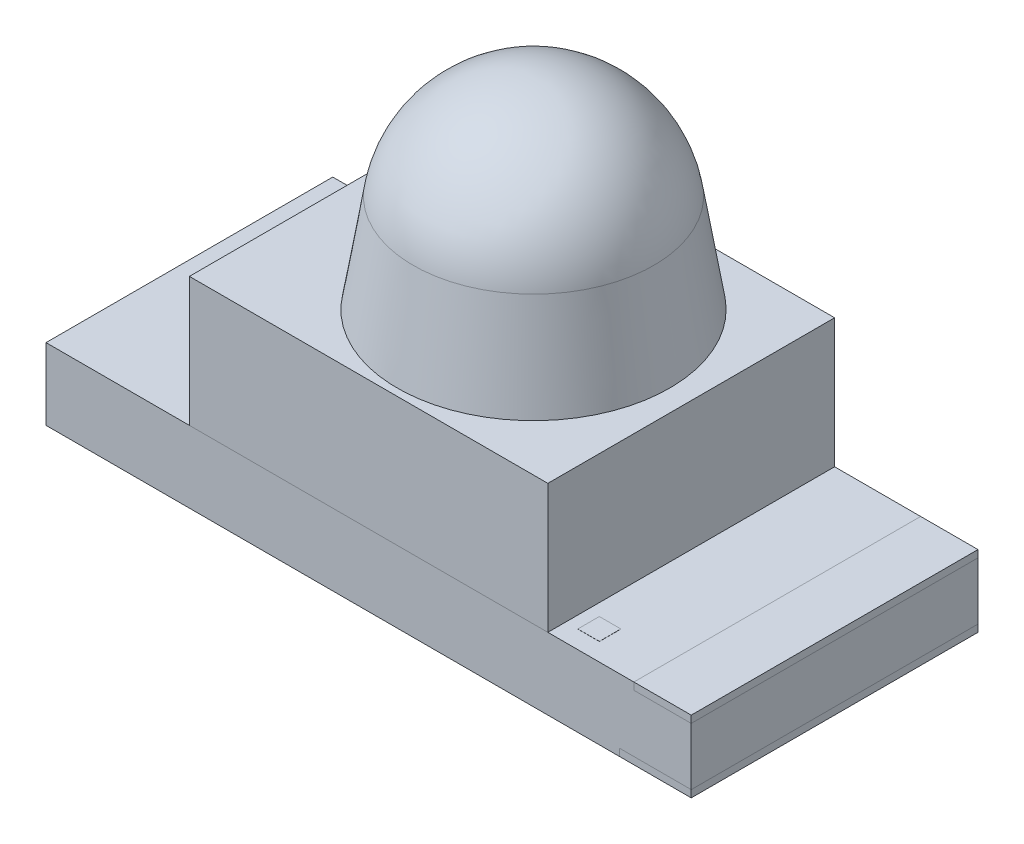
ISO-10303-21;
HEADER;
FILE_DESCRIPTION(('STEP AP214'),'2;1');
FILE_NAME('part.step','',(''),(''),'','','');
FILE_SCHEMA(('AUTOMOTIVE_DESIGN { 1 0 10303 214 1 1 1 1 }'));
ENDSEC;
DATA;
#1=APPLICATION_CONTEXT('core data for automotive mechanical design processes');
#2=APPLICATION_PROTOCOL_DEFINITION('international standard','automotive_design',2000,#1);
#3=PRODUCT_CONTEXT('',#1,'mechanical');
#4=PRODUCT('Part','Part','',(#3));
#5=PRODUCT_RELATED_PRODUCT_CATEGORY('part','',(#4));
#6=PRODUCT_DEFINITION_FORMATION('','',#4);
#7=PRODUCT_DEFINITION_CONTEXT('part definition',#1,'design');
#8=PRODUCT_DEFINITION('design','',#6,#7);
#9=PRODUCT_DEFINITION_SHAPE('','',#8);
#10=(LENGTH_UNIT() NAMED_UNIT(*) SI_UNIT(.MILLI.,.METRE.));
#11=(NAMED_UNIT(*) PLANE_ANGLE_UNIT() SI_UNIT($,.RADIAN.));
#12=(NAMED_UNIT(*) SI_UNIT($,.STERADIAN.) SOLID_ANGLE_UNIT());
#13=UNCERTAINTY_MEASURE_WITH_UNIT(LENGTH_MEASURE(1.E-05),#10,'distance_accuracy_value','');
#14=(GEOMETRIC_REPRESENTATION_CONTEXT(3) GLOBAL_UNCERTAINTY_ASSIGNED_CONTEXT((#13)) GLOBAL_UNIT_ASSIGNED_CONTEXT((#10,
#11,#12)) REPRESENTATION_CONTEXT('',''));
#15=CARTESIAN_POINT('',(0.,0.,0.));
#16=DIRECTION('',(0.,0.,1.));
#17=DIRECTION('',(1.,0.,0.));
#18=AXIS2_PLACEMENT_3D('',#15,#16,#17);
#19=CARTESIAN_POINT('',(-0.2,0.24,0.875846333056723));
#20=DIRECTION('',(0.,0.,-1.));
#21=DIRECTION('',(-1.,0.,0.));
#22=AXIS2_PLACEMENT_3D('',#19,#20,#21);
#23=PLANE('',#22);
#24=DIRECTION('',(0.,1.,0.));
#25=VECTOR('',#24,1.);
#26=CARTESIAN_POINT('',(1.48500300031996,0.24,0.875846333056723));
#27=LINE('',#26,#25);
#28=CARTESIAN_POINT('',(1.48500300031996,0.24,0.875846333056723));
#29=VERTEX_POINT('',#28);
#30=CARTESIAN_POINT('',(1.48500300031996,0.251,0.875846333056723));
#31=VERTEX_POINT('',#30);
#32=EDGE_CURVE('E47',#29,#31,#27,.T.);
#33=ORIENTED_EDGE('',*,*,#32,.T.);
#34=DIRECTION('',(-1.,0.,0.));
#35=VECTOR('',#34,1.);
#36=CARTESIAN_POINT('',(-0.2,0.251,0.875846333056723));
#37=LINE('',#36,#35);
#38=CARTESIAN_POINT('',(1.33500300031996,0.251,0.875846333056723));
#39=VERTEX_POINT('',#38);
#40=EDGE_CURVE('E86',#31,#39,#37,.T.);
#41=ORIENTED_EDGE('',*,*,#40,.T.);
#42=DIRECTION('',(0.,1.,0.));
#43=VECTOR('',#42,1.);
#44=CARTESIAN_POINT('',(1.33500300031996,0.24,0.875846333056723));
#45=LINE('',#44,#43);
#46=CARTESIAN_POINT('',(1.33500300031996,0.24,0.875846333056723));
#47=VERTEX_POINT('',#46);
#48=EDGE_CURVE('E12',#47,#39,#45,.T.);
#49=ORIENTED_EDGE('',*,*,#48,.F.);
#50=DIRECTION('',(-1.,0.,0.));
#51=VECTOR('',#50,1.);
#52=CARTESIAN_POINT('',(-0.2,0.24,0.875846333056723));
#53=LINE('',#52,#51);
#54=EDGE_CURVE('E88',#29,#47,#53,.T.);
#55=ORIENTED_EDGE('',*,*,#54,.F.);
#56=EDGE_LOOP('',(#33,#41,#49,#55));
#57=FACE_BOUND('',#56,.T.);
#58=ADVANCED_FACE('F44',(#57),#23,.F.);
#59=CARTESIAN_POINT('',(1.33500300031996,0.24,-3.68966740182096));
#60=DIRECTION('',(1.,0.,0.));
#61=DIRECTION('',(0.,0.,-1.));
#62=AXIS2_PLACEMENT_3D('',#59,#60,#61);
#63=PLANE('',#62);
#64=ORIENTED_EDGE('',*,*,#48,.T.);
#65=DIRECTION('',(0.,0.,-1.));
#66=VECTOR('',#65,1.);
#67=CARTESIAN_POINT('',(1.33500300031996,0.251,-3.68966740182096));
#68=LINE('',#67,#66);
#69=CARTESIAN_POINT('',(1.33500300031996,0.251,0.725846333056723));
#70=VERTEX_POINT('',#69);
#71=EDGE_CURVE('E103',#39,#70,#68,.T.);
#72=ORIENTED_EDGE('',*,*,#71,.T.);
#73=DIRECTION('',(0.,1.,0.));
#74=VECTOR('',#73,1.);
#75=CARTESIAN_POINT('',(1.33500300031996,0.24,0.725846333056723));
#76=LINE('',#75,#74);
#77=CARTESIAN_POINT('',(1.33500300031996,0.24,0.725846333056723));
#78=VERTEX_POINT('',#77);
#79=EDGE_CURVE('E52',#78,#70,#76,.T.);
#80=ORIENTED_EDGE('',*,*,#79,.F.);
#81=DIRECTION('',(0.,0.,-1.));
#82=VECTOR('',#81,1.);
#83=CARTESIAN_POINT('',(1.33500300031996,0.24,-3.68966740182096));
#84=LINE('',#83,#82);
#85=EDGE_CURVE('E59',#47,#78,#84,.T.);
#86=ORIENTED_EDGE('',*,*,#85,.F.);
#87=EDGE_LOOP('',(#64,#72,#80,#86));
#88=FACE_BOUND('',#87,.T.);
#89=ADVANCED_FACE('F117',(#88),#63,.F.);
#90=CARTESIAN_POINT('',(-0.199999999999997,0.24,0.725846333056724));
#91=DIRECTION('',(0.,0.,-1.));
#92=DIRECTION('',(-1.,0.,0.));
#93=AXIS2_PLACEMENT_3D('',#90,#91,#92);
#94=PLANE('',#93);
#95=ORIENTED_EDGE('',*,*,#79,.T.);
#96=DIRECTION('',(-1.,0.,0.));
#97=VECTOR('',#96,1.);
#98=CARTESIAN_POINT('',(-0.199999999999997,0.251,0.725846333056724));
#99=LINE('',#98,#97);
#100=CARTESIAN_POINT('',(1.48500300031996,0.251,0.725846333056723));
#101=VERTEX_POINT('',#100);
#102=EDGE_CURVE('E99',#101,#70,#99,.T.);
#103=ORIENTED_EDGE('',*,*,#102,.F.);
#104=DIRECTION('',(0.,1.,0.));
#105=VECTOR('',#104,1.);
#106=CARTESIAN_POINT('',(1.48500300031996,0.24,0.725846333056723));
#107=LINE('',#106,#105);
#108=CARTESIAN_POINT('',(1.48500300031996,0.24,0.725846333056723));
#109=VERTEX_POINT('',#108);
#110=EDGE_CURVE('E92',#109,#101,#107,.T.);
#111=ORIENTED_EDGE('',*,*,#110,.F.);
#112=DIRECTION('',(-1.,0.,0.));
#113=VECTOR('',#112,1.);
#114=CARTESIAN_POINT('',(-0.199999999999997,0.24,0.725846333056724));
#115=LINE('',#114,#113);
#116=EDGE_CURVE('E111',#109,#78,#115,.T.);
#117=ORIENTED_EDGE('',*,*,#116,.T.);
#118=EDGE_LOOP('',(#95,#103,#111,#117));
#119=FACE_BOUND('',#118,.T.);
#120=ADVANCED_FACE('F116',(#119),#94,.T.);
#121=CARTESIAN_POINT('',(1.48500300031996,0.24,-3.68966740182096));
#122=DIRECTION('',(1.,0.,0.));
#123=DIRECTION('',(0.,0.,-1.));
#124=AXIS2_PLACEMENT_3D('',#121,#122,#123);
#125=PLANE('',#124);
#126=ORIENTED_EDGE('',*,*,#110,.T.);
#127=DIRECTION('',(0.,0.,-1.));
#128=VECTOR('',#127,1.);
#129=CARTESIAN_POINT('',(1.48500300031996,0.251,-3.68966740182096));
#130=LINE('',#129,#128);
#131=EDGE_CURVE('E94',#31,#101,#130,.T.);
#132=ORIENTED_EDGE('',*,*,#131,.F.);
#133=ORIENTED_EDGE('',*,*,#32,.F.);
#134=DIRECTION('',(0.,0.,-1.));
#135=VECTOR('',#134,1.);
#136=CARTESIAN_POINT('',(1.48500300031996,0.24,-3.68966740182096));
#137=LINE('',#136,#135);
#138=EDGE_CURVE('E109',#29,#109,#137,.T.);
#139=ORIENTED_EDGE('',*,*,#138,.T.);
#140=EDGE_LOOP('',(#126,#132,#133,#139));
#141=FACE_BOUND('',#140,.T.);
#142=ADVANCED_FACE('F95',(#141),#125,.T.);
#143=CARTESIAN_POINT('',(-0.2,0.24,-3.68966740182096));
#144=DIRECTION('',(0.,-1.,0.));
#145=DIRECTION('',(0.,0.,-1.));
#146=AXIS2_PLACEMENT_3D('',#143,#144,#145);
#147=PLANE('',#146);
#148=ORIENTED_EDGE('',*,*,#54,.T.);
#149=ORIENTED_EDGE('',*,*,#85,.T.);
#150=ORIENTED_EDGE('',*,*,#116,.F.);
#151=ORIENTED_EDGE('',*,*,#138,.F.);
#152=EDGE_LOOP('',(#148,#149,#150,#151));
#153=FACE_BOUND('',#152,.T.);
#154=ADVANCED_FACE('F126',(#153),#147,.T.);
#155=CARTESIAN_POINT('',(-0.2,0.251,-3.68966740182096));
#156=DIRECTION('',(0.,-1.,0.));
#157=DIRECTION('',(0.,0.,-1.));
#158=AXIS2_PLACEMENT_3D('',#155,#156,#157);
#159=PLANE('',#158);
#160=ORIENTED_EDGE('',*,*,#40,.F.);
#161=ORIENTED_EDGE('',*,*,#131,.T.);
#162=ORIENTED_EDGE('',*,*,#102,.T.);
#163=ORIENTED_EDGE('',*,*,#71,.F.);
#164=EDGE_LOOP('',(#160,#161,#162,#163));
#165=FACE_BOUND('',#164,.T.);
#166=ADVANCED_FACE('F101',(#165),#159,.F.);
#167=CLOSED_SHELL('',(#58,#89,#120,#142,#154,#166));
#168=MANIFOLD_SOLID_BREP('B2',#167);
#169=CARTESIAN_POINT('',(0.0565024962447392,-0.200000000000001,1.));
#170=DIRECTION('',(0.,-1.,0.));
#171=DIRECTION('',(1.,0.,0.));
#172=AXIS2_PLACEMENT_3D('',#169,#170,#171);
#173=PLANE('',#172);
#174=DIRECTION('',(-1.,0.,0.));
#175=VECTOR('',#174,1.);
#176=CARTESIAN_POINT('',(0.0565024962447392,-0.200000000000001,-1.));
#177=LINE('',#176,#175);
#178=CARTESIAN_POINT('',(2.25,-0.2,-1.));
#179=VERTEX_POINT('',#178);
#180=CARTESIAN_POINT('',(1.75,-0.2,-1.));
#181=VERTEX_POINT('',#180);
#182=EDGE_CURVE('E224',#179,#181,#177,.T.);
#183=ORIENTED_EDGE('',*,*,#182,.T.);
#184=DIRECTION('',(0.,0.,-1.));
#185=VECTOR('',#184,1.);
#186=CARTESIAN_POINT('',(1.75,-0.2,1.));
#187=LINE('',#186,#185);
#188=CARTESIAN_POINT('',(1.75,-0.2,1.));
#189=VERTEX_POINT('',#188);
#190=EDGE_CURVE('E42',#189,#181,#187,.T.);
#191=ORIENTED_EDGE('',*,*,#190,.F.);
#192=DIRECTION('',(-1.,0.,0.));
#193=VECTOR('',#192,1.);
#194=CARTESIAN_POINT('',(0.0565024962447392,-0.200000000000001,1.));
#195=LINE('',#194,#193);
#196=CARTESIAN_POINT('',(2.25,-0.2,1.));
#197=VERTEX_POINT('',#196);
#198=EDGE_CURVE('E241',#197,#189,#195,.T.);
#199=ORIENTED_EDGE('',*,*,#198,.F.);
#200=DIRECTION('',(0.,0.,-1.));
#201=VECTOR('',#200,1.);
#202=CARTESIAN_POINT('',(2.25,-0.2,1.));
#203=LINE('',#202,#201);
#204=EDGE_CURVE('E192',#197,#179,#203,.T.);
#205=ORIENTED_EDGE('',*,*,#204,.T.);
#206=EDGE_LOOP('',(#183,#191,#199,#205));
#207=FACE_BOUND('',#206,.T.);
#208=ADVANCED_FACE('F178',(#207),#173,.F.);
#209=CARTESIAN_POINT('',(1.75000000000003,-3.84653576035237,1.));
#210=DIRECTION('',(1.,0.,0.));
#211=DIRECTION('',(0.,1.,0.));
#212=AXIS2_PLACEMENT_3D('',#209,#210,#211);
#213=PLANE('',#212);
#214=DIRECTION('',(0.,-1.,0.));
#215=VECTOR('',#214,1.);
#216=CARTESIAN_POINT('',(1.75000000000003,-3.84653576035237,-1.));
#217=LINE('',#216,#215);
#218=CARTESIAN_POINT('',(1.75,-0.25,-1.));
#219=VERTEX_POINT('',#218);
#220=EDGE_CURVE('E220',#181,#219,#217,.T.);
#221=ORIENTED_EDGE('',*,*,#220,.T.);
#222=DIRECTION('',(0.,0.,-1.));
#223=VECTOR('',#222,1.);
#224=CARTESIAN_POINT('',(1.75,-0.25,1.));
#225=LINE('',#224,#223);
#226=CARTESIAN_POINT('',(1.75,-0.25,1.));
#227=VERTEX_POINT('',#226);
#228=EDGE_CURVE('E185',#227,#219,#225,.T.);
#229=ORIENTED_EDGE('',*,*,#228,.F.);
#230=DIRECTION('',(0.,-1.,0.));
#231=VECTOR('',#230,1.);
#232=CARTESIAN_POINT('',(1.75000000000003,-3.84653576035237,1.));
#233=LINE('',#232,#231);
#234=EDGE_CURVE('E233',#189,#227,#233,.T.);
#235=ORIENTED_EDGE('',*,*,#234,.F.);
#236=ORIENTED_EDGE('',*,*,#190,.T.);
#237=EDGE_LOOP('',(#221,#229,#235,#236));
#238=FACE_BOUND('',#237,.T.);
#239=ADVANCED_FACE('F232',(#238),#213,.F.);
#240=CARTESIAN_POINT('',(0.0565024962447396,-0.25,1.));
#241=DIRECTION('',(0.,1.,0.));
#242=DIRECTION('',(0.,0.,1.));
#243=AXIS2_PLACEMENT_3D('',#240,#241,#242);
#244=PLANE('',#243);
#245=DIRECTION('',(1.,0.,0.));
#246=VECTOR('',#245,1.);
#247=CARTESIAN_POINT('',(0.0565024962447396,-0.25,-1.));
#248=LINE('',#247,#246);
#249=CARTESIAN_POINT('',(2.25,-0.25,-1.));
#250=VERTEX_POINT('',#249);
#251=EDGE_CURVE('E226',#219,#250,#248,.T.);
#252=ORIENTED_EDGE('',*,*,#251,.T.);
#253=DIRECTION('',(0.,0.,-1.));
#254=VECTOR('',#253,1.);
#255=CARTESIAN_POINT('',(2.25,-0.25,1.));
#256=LINE('',#255,#254);
#257=CARTESIAN_POINT('',(2.25,-0.25,1.));
#258=VERTEX_POINT('',#257);
#259=EDGE_CURVE('E248',#258,#250,#256,.T.);
#260=ORIENTED_EDGE('',*,*,#259,.F.);
#261=DIRECTION('',(1.,0.,0.));
#262=VECTOR('',#261,1.);
#263=CARTESIAN_POINT('',(0.0565024962447396,-0.25,1.));
#264=LINE('',#263,#262);
#265=EDGE_CURVE('E200',#227,#258,#264,.T.);
#266=ORIENTED_EDGE('',*,*,#265,.F.);
#267=ORIENTED_EDGE('',*,*,#228,.T.);
#268=EDGE_LOOP('',(#252,#260,#266,#267));
#269=FACE_BOUND('',#268,.T.);
#270=ADVANCED_FACE('F250',(#269),#244,.F.);
#271=CARTESIAN_POINT('',(2.25,-3.84653576035239,1.));
#272=DIRECTION('',(1.,0.,0.));
#273=DIRECTION('',(0.,1.,0.));
#274=AXIS2_PLACEMENT_3D('',#271,#272,#273);
#275=PLANE('',#274);
#276=DIRECTION('',(0.,-1.,0.));
#277=VECTOR('',#276,1.);
#278=CARTESIAN_POINT('',(2.25,-3.84653576035239,-1.));
#279=LINE('',#278,#277);
#280=EDGE_CURVE('E239',#179,#250,#279,.T.);
#281=ORIENTED_EDGE('',*,*,#280,.F.);
#282=ORIENTED_EDGE('',*,*,#204,.F.);
#283=DIRECTION('',(0.,-1.,0.));
#284=VECTOR('',#283,1.);
#285=CARTESIAN_POINT('',(2.25,-3.84653576035239,1.));
#286=LINE('',#285,#284);
#287=EDGE_CURVE('E245',#197,#258,#286,.T.);
#288=ORIENTED_EDGE('',*,*,#287,.T.);
#289=ORIENTED_EDGE('',*,*,#259,.T.);
#290=EDGE_LOOP('',(#281,#282,#288,#289));
#291=FACE_BOUND('',#290,.T.);
#292=ADVANCED_FACE('F251',(#291),#275,.T.);
#293=CARTESIAN_POINT('',(0.0565024962447396,-3.84653576035239,1.));
#294=DIRECTION('',(0.,0.,1.));
#295=DIRECTION('',(1.,0.,0.));
#296=AXIS2_PLACEMENT_3D('',#293,#294,#295);
#297=PLANE('',#296);
#298=ORIENTED_EDGE('',*,*,#198,.T.);
#299=ORIENTED_EDGE('',*,*,#234,.T.);
#300=ORIENTED_EDGE('',*,*,#265,.T.);
#301=ORIENTED_EDGE('',*,*,#287,.F.);
#302=EDGE_LOOP('',(#298,#299,#300,#301));
#303=FACE_BOUND('',#302,.T.);
#304=ADVANCED_FACE('F252',(#303),#297,.T.);
#305=CARTESIAN_POINT('',(0.0565024962447396,-3.84653576035239,-1.));
#306=DIRECTION('',(0.,0.,1.));
#307=DIRECTION('',(1.,0.,0.));
#308=AXIS2_PLACEMENT_3D('',#305,#306,#307);
#309=PLANE('',#308);
#310=ORIENTED_EDGE('',*,*,#182,.F.);
#311=ORIENTED_EDGE('',*,*,#280,.T.);
#312=ORIENTED_EDGE('',*,*,#251,.F.);
#313=ORIENTED_EDGE('',*,*,#220,.F.);
#314=EDGE_LOOP('',(#310,#311,#312,#313));
#315=FACE_BOUND('',#314,.T.);
#316=ADVANCED_FACE('F221',(#315),#309,.F.);
#317=CLOSED_SHELL('',(#208,#239,#270,#292,#304,#316));
#318=MANIFOLD_SOLID_BREP('B6',#317);
#319=CARTESIAN_POINT('',(1.85000000000002,-3.84653576035238,1.));
#320=DIRECTION('',(1.,0.,0.));
#321=DIRECTION('',(0.,1.,0.));
#322=AXIS2_PLACEMENT_3D('',#319,#320,#321);
#323=PLANE('',#322);
#324=DIRECTION('',(0.,-1.,0.));
#325=VECTOR('',#324,1.);
#326=CARTESIAN_POINT('',(1.85000000000002,-3.84653576035238,-1.));
#327=LINE('',#326,#325);
#328=CARTESIAN_POINT('',(1.85,0.25,-1.));
#329=VERTEX_POINT('',#328);
#330=CARTESIAN_POINT('',(1.85,0.2,-1.));
#331=VERTEX_POINT('',#330);
#332=EDGE_CURVE('E359',#329,#331,#327,.T.);
#333=ORIENTED_EDGE('',*,*,#332,.T.);
#334=DIRECTION('',(0.,0.,-1.));
#335=VECTOR('',#334,1.);
#336=CARTESIAN_POINT('',(1.85,0.2,1.));
#337=LINE('',#336,#335);
#338=CARTESIAN_POINT('',(1.85,0.2,1.));
#339=VERTEX_POINT('',#338);
#340=EDGE_CURVE('E176',#339,#331,#337,.T.);
#341=ORIENTED_EDGE('',*,*,#340,.F.);
#342=DIRECTION('',(0.,-1.,0.));
#343=VECTOR('',#342,1.);
#344=CARTESIAN_POINT('',(1.85000000000002,-3.84653576035238,1.));
#345=LINE('',#344,#343);
#346=CARTESIAN_POINT('',(1.85,0.25,1.));
#347=VERTEX_POINT('',#346);
#348=EDGE_CURVE('E374',#347,#339,#345,.T.);
#349=ORIENTED_EDGE('',*,*,#348,.F.);
#350=DIRECTION('',(0.,0.,-1.));
#351=VECTOR('',#350,1.);
#352=CARTESIAN_POINT('',(1.85,0.25,1.));
#353=LINE('',#352,#351);
#354=EDGE_CURVE('E326',#347,#329,#353,.T.);
#355=ORIENTED_EDGE('',*,*,#354,.T.);
#356=EDGE_LOOP('',(#333,#341,#349,#355));
#357=FACE_BOUND('',#356,.T.);
#358=ADVANCED_FACE('F312',(#357),#323,.F.);
#359=CARTESIAN_POINT('',(0.0565024962447396,0.2,1.));
#360=DIRECTION('',(0.,1.,0.));
#361=DIRECTION('',(0.,0.,1.));
#362=AXIS2_PLACEMENT_3D('',#359,#360,#361);
#363=PLANE('',#362);
#364=DIRECTION('',(1.,0.,0.));
#365=VECTOR('',#364,1.);
#366=CARTESIAN_POINT('',(0.0565024962447396,0.2,-1.));
#367=LINE('',#366,#365);
#368=CARTESIAN_POINT('',(2.25,0.2,-1.));
#369=VERTEX_POINT('',#368);
#370=EDGE_CURVE('E355',#331,#369,#367,.T.);
#371=ORIENTED_EDGE('',*,*,#370,.T.);
#372=DIRECTION('',(0.,0.,-1.));
#373=VECTOR('',#372,1.);
#374=CARTESIAN_POINT('',(2.25,0.2,1.));
#375=LINE('',#374,#373);
#376=CARTESIAN_POINT('',(2.25,0.2,1.));
#377=VERTEX_POINT('',#376);
#378=EDGE_CURVE('E319',#377,#369,#375,.T.);
#379=ORIENTED_EDGE('',*,*,#378,.F.);
#380=DIRECTION('',(1.,0.,0.));
#381=VECTOR('',#380,1.);
#382=CARTESIAN_POINT('',(0.0565024962447396,0.2,1.));
#383=LINE('',#382,#381);
#384=EDGE_CURVE('E366',#339,#377,#383,.T.);
#385=ORIENTED_EDGE('',*,*,#384,.F.);
#386=ORIENTED_EDGE('',*,*,#340,.T.);
#387=EDGE_LOOP('',(#371,#379,#385,#386));
#388=FACE_BOUND('',#387,.T.);
#389=ADVANCED_FACE('F365',(#388),#363,.F.);
#390=CARTESIAN_POINT('',(2.25,-3.84653576035239,1.));
#391=DIRECTION('',(1.,0.,0.));
#392=DIRECTION('',(0.,1.,0.));
#393=AXIS2_PLACEMENT_3D('',#390,#391,#392);
#394=PLANE('',#393);
#395=DIRECTION('',(0.,-1.,0.));
#396=VECTOR('',#395,1.);
#397=CARTESIAN_POINT('',(2.25,-3.84653576035239,-1.));
#398=LINE('',#397,#396);
#399=CARTESIAN_POINT('',(2.25,0.25,-1.));
#400=VERTEX_POINT('',#399);
#401=EDGE_CURVE('E360',#400,#369,#398,.T.);
#402=ORIENTED_EDGE('',*,*,#401,.F.);
#403=DIRECTION('',(0.,0.,-1.));
#404=VECTOR('',#403,1.);
#405=CARTESIAN_POINT('',(2.25,0.25,1.));
#406=LINE('',#405,#404);
#407=CARTESIAN_POINT('',(2.25,0.25,1.));
#408=VERTEX_POINT('',#407);
#409=EDGE_CURVE('E334',#408,#400,#406,.T.);
#410=ORIENTED_EDGE('',*,*,#409,.F.);
#411=DIRECTION('',(0.,-1.,0.));
#412=VECTOR('',#411,1.);
#413=CARTESIAN_POINT('',(2.25,-3.84653576035239,1.));
#414=LINE('',#413,#412);
#415=EDGE_CURVE('E377',#408,#377,#414,.T.);
#416=ORIENTED_EDGE('',*,*,#415,.T.);
#417=ORIENTED_EDGE('',*,*,#378,.T.);
#418=EDGE_LOOP('',(#402,#410,#416,#417));
#419=FACE_BOUND('',#418,.T.);
#420=ADVANCED_FACE('F382',(#419),#394,.T.);
#421=CARTESIAN_POINT('',(0.0565024962447396,0.25,1.));
#422=DIRECTION('',(0.,1.,0.));
#423=DIRECTION('',(0.,0.,1.));
#424=AXIS2_PLACEMENT_3D('',#421,#422,#423);
#425=PLANE('',#424);
#426=DIRECTION('',(1.,0.,0.));
#427=VECTOR('',#426,1.);
#428=CARTESIAN_POINT('',(0.0565024962447396,0.25,-1.));
#429=LINE('',#428,#427);
#430=EDGE_CURVE('E372',#329,#400,#429,.T.);
#431=ORIENTED_EDGE('',*,*,#430,.F.);
#432=ORIENTED_EDGE('',*,*,#354,.F.);
#433=DIRECTION('',(1.,0.,0.));
#434=VECTOR('',#433,1.);
#435=CARTESIAN_POINT('',(0.0565024962447396,0.25,1.));
#436=LINE('',#435,#434);
#437=EDGE_CURVE('E379',#347,#408,#436,.T.);
#438=ORIENTED_EDGE('',*,*,#437,.T.);
#439=ORIENTED_EDGE('',*,*,#409,.T.);
#440=EDGE_LOOP('',(#431,#432,#438,#439));
#441=FACE_BOUND('',#440,.T.);
#442=ADVANCED_FACE('F386',(#441),#425,.T.);
#443=CARTESIAN_POINT('',(0.0565024962447396,-3.84653576035239,1.));
#444=DIRECTION('',(0.,0.,1.));
#445=DIRECTION('',(1.,0.,0.));
#446=AXIS2_PLACEMENT_3D('',#443,#444,#445);
#447=PLANE('',#446);
#448=ORIENTED_EDGE('',*,*,#348,.T.);
#449=ORIENTED_EDGE('',*,*,#384,.T.);
#450=ORIENTED_EDGE('',*,*,#415,.F.);
#451=ORIENTED_EDGE('',*,*,#437,.F.);
#452=EDGE_LOOP('',(#448,#449,#450,#451));
#453=FACE_BOUND('',#452,.T.);
#454=ADVANCED_FACE('F385',(#453),#447,.T.);
#455=CARTESIAN_POINT('',(0.0565024962447396,-3.84653576035239,-1.));
#456=DIRECTION('',(0.,0.,1.));
#457=DIRECTION('',(1.,0.,0.));
#458=AXIS2_PLACEMENT_3D('',#455,#456,#457);
#459=PLANE('',#458);
#460=ORIENTED_EDGE('',*,*,#332,.F.);
#461=ORIENTED_EDGE('',*,*,#430,.T.);
#462=ORIENTED_EDGE('',*,*,#401,.T.);
#463=ORIENTED_EDGE('',*,*,#370,.F.);
#464=EDGE_LOOP('',(#460,#461,#462,#463));
#465=FACE_BOUND('',#464,.T.);
#466=ADVANCED_FACE('F356',(#465),#459,.F.);
#467=CLOSED_SHELL('',(#358,#389,#420,#442,#454,#466));
#468=MANIFOLD_SOLID_BREP('B36',#467);
#469=CARTESIAN_POINT('',(0.0565024962447392,1.15,1.));
#470=DIRECTION('',(0.,1.,0.));
#471=DIRECTION('',(-1.,0.,0.));
#472=AXIS2_PLACEMENT_3D('',#469,#470,#471);
#473=PLANE('',#472);
#474=DIRECTION('',(1.,0.,0.));
#475=VECTOR('',#474,1.);
#476=CARTESIAN_POINT('',(0.0565024962447392,1.15,-1.));
#477=LINE('',#476,#475);
#478=CARTESIAN_POINT('',(-1.25,1.15,-1.));
#479=VERTEX_POINT('',#478);
#480=CARTESIAN_POINT('',(1.25,1.15,-1.));
#481=VERTEX_POINT('',#480);
#482=EDGE_CURVE('E489',#479,#481,#477,.T.);
#483=ORIENTED_EDGE('',*,*,#482,.F.);
#484=DIRECTION('',(0.,0.,-1.));
#485=VECTOR('',#484,1.);
#486=CARTESIAN_POINT('',(-1.25,1.15,1.));
#487=LINE('',#486,#485);
#488=CARTESIAN_POINT('',(-1.25,1.15,1.));
#489=VERTEX_POINT('',#488);
#490=EDGE_CURVE('E453',#489,#479,#487,.T.);
#491=ORIENTED_EDGE('',*,*,#490,.F.);
#492=DIRECTION('',(1.,0.,0.));
#493=VECTOR('',#492,1.);
#494=CARTESIAN_POINT('',(0.0565024962447392,1.15,1.));
#495=LINE('',#494,#493);
#496=CARTESIAN_POINT('',(1.25,1.15,1.));
#497=VERTEX_POINT('',#496);
#498=EDGE_CURVE('E490',#489,#497,#495,.T.);
#499=ORIENTED_EDGE('',*,*,#498,.T.);
#500=DIRECTION('',(0.,0.,-1.));
#501=VECTOR('',#500,1.);
#502=CARTESIAN_POINT('',(1.25,1.15,1.));
#503=LINE('',#502,#501);
#504=EDGE_CURVE('E310',#497,#481,#503,.T.);
#505=ORIENTED_EDGE('',*,*,#504,.T.);
#506=EDGE_LOOP('',(#483,#491,#499,#505));
#507=FACE_BOUND('',#506,.T.);
#508=CARTESIAN_POINT('',(0.15,1.15,0.));
#509=DIRECTION('',(0.,-1.,0.));
#510=DIRECTION('',(0.,0.,-1.));
#511=AXIS2_PLACEMENT_3D('',#508,#509,#510);
#512=CIRCLE('',#511,0.95);
#513=CARTESIAN_POINT('',(0.15,1.15,-0.95));
#514=VERTEX_POINT('',#513);
#515=EDGE_CURVE('E499',#514,#514,#512,.T.);
#516=ORIENTED_EDGE('',*,*,#515,.T.);
#517=EDGE_LOOP('',(#516));
#518=FACE_BOUND('',#517,.T.);
#519=ADVANCED_FACE('F445',(#507,#518),#473,.T.);
#520=CARTESIAN_POINT('',(1.25,-3.84653576035238,1.));
#521=DIRECTION('',(1.,0.,0.));
#522=DIRECTION('',(0.,1.,0.));
#523=AXIS2_PLACEMENT_3D('',#520,#521,#522);
#524=PLANE('',#523);
#525=DIRECTION('',(0.,-1.,0.));
#526=VECTOR('',#525,1.);
#527=CARTESIAN_POINT('',(1.25,-3.84653576035238,-1.));
#528=LINE('',#527,#526);
#529=CARTESIAN_POINT('',(1.25,0.25,-1.));
#530=VERTEX_POINT('',#529);
#531=EDGE_CURVE('E494',#481,#530,#528,.T.);
#532=ORIENTED_EDGE('',*,*,#531,.F.);
#533=ORIENTED_EDGE('',*,*,#504,.F.);
#534=DIRECTION('',(0.,-1.,0.));
#535=VECTOR('',#534,1.);
#536=CARTESIAN_POINT('',(1.25,-3.84653576035238,1.));
#537=LINE('',#536,#535);
#538=CARTESIAN_POINT('',(1.25,0.25,1.));
#539=VERTEX_POINT('',#538);
#540=EDGE_CURVE('E510',#497,#539,#537,.T.);
#541=ORIENTED_EDGE('',*,*,#540,.T.);
#542=DIRECTION('',(0.,0.,-1.));
#543=VECTOR('',#542,1.);
#544=CARTESIAN_POINT('',(1.25,0.25,1.));
#545=LINE('',#544,#543);
#546=EDGE_CURVE('E495',#539,#530,#545,.T.);
#547=ORIENTED_EDGE('',*,*,#546,.T.);
#548=EDGE_LOOP('',(#532,#533,#541,#547));
#549=FACE_BOUND('',#548,.T.);
#550=ADVANCED_FACE('F447',(#549),#524,.T.);
#551=CARTESIAN_POINT('',(-1.25,-3.84653576035239,1.));
#552=DIRECTION('',(1.,0.,0.));
#553=DIRECTION('',(0.,1.,0.));
#554=AXIS2_PLACEMENT_3D('',#551,#552,#553);
#555=PLANE('',#554);
#556=DIRECTION('',(0.,-1.,0.));
#557=VECTOR('',#556,1.);
#558=CARTESIAN_POINT('',(-1.25,-3.84653576035239,-1.));
#559=LINE('',#558,#557);
#560=CARTESIAN_POINT('',(-1.25,0.25,-1.));
#561=VERTEX_POINT('',#560);
#562=EDGE_CURVE('E503',#479,#561,#559,.T.);
#563=ORIENTED_EDGE('',*,*,#562,.T.);
#564=DIRECTION('',(0.,0.,-1.));
#565=VECTOR('',#564,1.);
#566=CARTESIAN_POINT('',(-1.25,0.25,1.));
#567=LINE('',#566,#565);
#568=CARTESIAN_POINT('',(-1.25,0.25,1.));
#569=VERTEX_POINT('',#568);
#570=EDGE_CURVE('E516',#569,#561,#567,.T.);
#571=ORIENTED_EDGE('',*,*,#570,.F.);
#572=DIRECTION('',(0.,-1.,0.));
#573=VECTOR('',#572,1.);
#574=CARTESIAN_POINT('',(-1.25,-3.84653576035239,1.));
#575=LINE('',#574,#573);
#576=EDGE_CURVE('E465',#489,#569,#575,.T.);
#577=ORIENTED_EDGE('',*,*,#576,.F.);
#578=ORIENTED_EDGE('',*,*,#490,.T.);
#579=EDGE_LOOP('',(#563,#571,#577,#578));
#580=FACE_BOUND('',#579,.T.);
#581=ADVANCED_FACE('F519',(#580),#555,.F.);
#582=CARTESIAN_POINT('',(0.0565024962447396,0.25,1.));
#583=DIRECTION('',(0.,1.,0.));
#584=DIRECTION('',(0.,0.,1.));
#585=AXIS2_PLACEMENT_3D('',#582,#583,#584);
#586=PLANE('',#585);
#587=DIRECTION('',(1.,0.,0.));
#588=VECTOR('',#587,1.);
#589=CARTESIAN_POINT('',(0.0565024962447396,0.25,-1.));
#590=LINE('',#589,#588);
#591=EDGE_CURVE('E505',#561,#530,#590,.T.);
#592=ORIENTED_EDGE('',*,*,#591,.T.);
#593=ORIENTED_EDGE('',*,*,#546,.F.);
#594=DIRECTION('',(1.,0.,0.));
#595=VECTOR('',#594,1.);
#596=CARTESIAN_POINT('',(0.0565024962447396,0.25,1.));
#597=LINE('',#596,#595);
#598=EDGE_CURVE('E460',#569,#539,#597,.T.);
#599=ORIENTED_EDGE('',*,*,#598,.F.);
#600=ORIENTED_EDGE('',*,*,#570,.T.);
#601=EDGE_LOOP('',(#592,#593,#599,#600));
#602=FACE_BOUND('',#601,.T.);
#603=ADVANCED_FACE('F522',(#602),#586,.F.);
#604=CARTESIAN_POINT('',(0.0565024962447396,-3.84653576035239,1.));
#605=DIRECTION('',(0.,0.,1.));
#606=DIRECTION('',(1.,0.,0.));
#607=AXIS2_PLACEMENT_3D('',#604,#605,#606);
#608=PLANE('',#607);
#609=ORIENTED_EDGE('',*,*,#540,.F.);
#610=ORIENTED_EDGE('',*,*,#498,.F.);
#611=ORIENTED_EDGE('',*,*,#576,.T.);
#612=ORIENTED_EDGE('',*,*,#598,.T.);
#613=EDGE_LOOP('',(#609,#610,#611,#612));
#614=FACE_BOUND('',#613,.T.);
#615=ADVANCED_FACE('F520',(#614),#608,.T.);
#616=CARTESIAN_POINT('',(0.0565024962447396,-3.84653576035239,-1.));
#617=DIRECTION('',(0.,0.,1.));
#618=DIRECTION('',(1.,0.,0.));
#619=AXIS2_PLACEMENT_3D('',#616,#617,#618);
#620=PLANE('',#619);
#621=ORIENTED_EDGE('',*,*,#531,.T.);
#622=ORIENTED_EDGE('',*,*,#591,.F.);
#623=ORIENTED_EDGE('',*,*,#562,.F.);
#624=ORIENTED_EDGE('',*,*,#482,.T.);
#625=EDGE_LOOP('',(#621,#622,#623,#624));
#626=FACE_BOUND('',#625,.T.);
#627=ADVANCED_FACE('F502',(#626),#620,.F.);
#628=CARTESIAN_POINT('',(0.15,1.7,0.));
#629=DIRECTION('',(0.,-1.,0.));
#630=DIRECTION('',(-1.,0.,0.));
#631=AXIS2_PLACEMENT_3D('',#628,#629,#630);
#632=SPHERICAL_SURFACE('',#631,0.85);
#633=CARTESIAN_POINT('',(0.15,1.83571155690791,0.));
#634=DIRECTION('',(0.,-1.,0.));
#635=DIRECTION('',(0.,0.,-1.));
#636=AXIS2_PLACEMENT_3D('',#633,#634,#635);
#637=CIRCLE('',#636,0.839096164525634);
#638=CARTESIAN_POINT('',(0.15,1.83571155690791,-0.839096164525634));
#639=VERTEX_POINT('',#638);
#640=EDGE_CURVE('E590',#639,#639,#637,.T.);
#641=ORIENTED_EDGE('',*,*,#640,.F.);
#642=EDGE_LOOP('',(#641));
#643=FACE_BOUND('',#642,.T.);
#644=ADVANCED_FACE('F528',(#643),#632,.T.);
#645=CARTESIAN_POINT('',(0.15,1.83571155690791,0.));
#646=DIRECTION('',(0.,-1.,0.));
#647=DIRECTION('',(0.,0.,-1.));
#648=AXIS2_PLACEMENT_3D('',#645,#646,#647);
#649=CONICAL_SURFACE('',#648,0.839096164525634,0.160346888877263);
#650=ORIENTED_EDGE('',*,*,#515,.F.);
#651=EDGE_LOOP('',(#650));
#652=FACE_BOUND('',#651,.T.);
#653=ORIENTED_EDGE('',*,*,#640,.T.);
#654=EDGE_LOOP('',(#653));
#655=FACE_BOUND('',#654,.T.);
#656=ADVANCED_FACE('F571',(#652,#655),#649,.T.);
#657=CLOSED_SHELL('',(#519,#550,#581,#603,#615,#627,#644,#656));
#658=MANIFOLD_SOLID_BREP('B170',#657);
#659=CARTESIAN_POINT('',(1.75000000000003,-3.84653576035237,1.));
#660=DIRECTION('',(1.,0.,0.));
#661=DIRECTION('',(0.,1.,0.));
#662=AXIS2_PLACEMENT_3D('',#659,#660,#661);
#663=PLANE('',#662);
#664=DIRECTION('',(0.,-1.,0.));
#665=VECTOR('',#664,1.);
#666=CARTESIAN_POINT('',(1.75000000000003,-3.84653576035237,-1.));
#667=LINE('',#666,#665);
#668=CARTESIAN_POINT('',(1.75,-0.2,-1.));
#669=VERTEX_POINT('',#668);
#670=CARTESIAN_POINT('',(1.75,-0.25,-1.));
#671=VERTEX_POINT('',#670);
#672=EDGE_CURVE('E679',#669,#671,#667,.T.);
#673=ORIENTED_EDGE('',*,*,#672,.F.);
#674=DIRECTION('',(0.,0.,-1.));
#675=VECTOR('',#674,1.);
#676=CARTESIAN_POINT('',(1.75,-0.2,1.));
#677=LINE('',#676,#675);
#678=CARTESIAN_POINT('',(1.75,-0.2,1.));
#679=VERTEX_POINT('',#678);
#680=EDGE_CURVE('E443',#679,#669,#677,.T.);
#681=ORIENTED_EDGE('',*,*,#680,.F.);
#682=DIRECTION('',(0.,-1.,0.));
#683=VECTOR('',#682,1.);
#684=CARTESIAN_POINT('',(1.75000000000003,-3.84653576035237,1.));
#685=LINE('',#684,#683);
#686=CARTESIAN_POINT('',(1.75,-0.25,1.));
#687=VERTEX_POINT('',#686);
#688=EDGE_CURVE('E704',#679,#687,#685,.T.);
#689=ORIENTED_EDGE('',*,*,#688,.T.);
#690=DIRECTION('',(0.,0.,-1.));
#691=VECTOR('',#690,1.);
#692=CARTESIAN_POINT('',(1.75,-0.25,1.));
#693=LINE('',#692,#691);
#694=EDGE_CURVE('E680',#687,#671,#693,.T.);
#695=ORIENTED_EDGE('',*,*,#694,.T.);
#696=EDGE_LOOP('',(#673,#681,#689,#695));
#697=FACE_BOUND('',#696,.T.);
#698=ADVANCED_FACE('F605',(#697),#663,.T.);
#699=CARTESIAN_POINT('',(0.0565024962447392,-0.200000000000001,1.));
#700=DIRECTION('',(0.,-1.,0.));
#701=DIRECTION('',(1.,0.,0.));
#702=AXIS2_PLACEMENT_3D('',#699,#700,#701);
#703=PLANE('',#702);
#704=DIRECTION('',(-1.,0.,0.));
#705=VECTOR('',#704,1.);
#706=CARTESIAN_POINT('',(0.0565024962447392,-0.200000000000001,-1.));
#707=LINE('',#706,#705);
#708=CARTESIAN_POINT('',(2.25,-0.2,-1.));
#709=VERTEX_POINT('',#708);
#710=EDGE_CURVE('E672',#709,#669,#707,.T.);
#711=ORIENTED_EDGE('',*,*,#710,.F.);
#712=DIRECTION('',(0.,0.,-1.));
#713=VECTOR('',#712,1.);
#714=CARTESIAN_POINT('',(2.25,-0.2,1.));
#715=LINE('',#714,#713);
#716=CARTESIAN_POINT('',(2.25,-0.2,1.));
#717=VERTEX_POINT('',#716);
#718=EDGE_CURVE('E612',#717,#709,#715,.T.);
#719=ORIENTED_EDGE('',*,*,#718,.F.);
#720=DIRECTION('',(-1.,0.,0.));
#721=VECTOR('',#720,1.);
#722=CARTESIAN_POINT('',(0.0565024962447392,-0.200000000000001,1.));
#723=LINE('',#722,#721);
#724=EDGE_CURVE('E675',#717,#679,#723,.T.);
#725=ORIENTED_EDGE('',*,*,#724,.T.);
#726=ORIENTED_EDGE('',*,*,#680,.T.);
#727=EDGE_LOOP('',(#711,#719,#725,#726));
#728=FACE_BOUND('',#727,.T.);
#729=ADVANCED_FACE('F670',(#728),#703,.T.);
#730=CARTESIAN_POINT('',(2.25,-3.84653576035239,1.));
#731=DIRECTION('',(1.,0.,0.));
#732=DIRECTION('',(0.,1.,0.));
#733=AXIS2_PLACEMENT_3D('',#730,#731,#732);
#734=PLANE('',#733);
#735=DIRECTION('',(0.,-1.,0.));
#736=VECTOR('',#735,1.);
#737=CARTESIAN_POINT('',(2.25,-3.84653576035239,-1.));
#738=LINE('',#737,#736);
#739=CARTESIAN_POINT('',(2.25,0.2,-1.));
#740=VERTEX_POINT('',#739);
#741=EDGE_CURVE('E688',#740,#709,#738,.T.);
#742=ORIENTED_EDGE('',*,*,#741,.F.);
#743=DIRECTION('',(0.,0.,-1.));
#744=VECTOR('',#743,1.);
#745=CARTESIAN_POINT('',(2.25,0.2,1.));
#746=LINE('',#745,#744);
#747=CARTESIAN_POINT('',(2.25,0.2,1.));
#748=VERTEX_POINT('',#747);
#749=EDGE_CURVE('E731',#748,#740,#746,.T.);
#750=ORIENTED_EDGE('',*,*,#749,.F.);
#751=DIRECTION('',(0.,-1.,0.));
#752=VECTOR('',#751,1.);
#753=CARTESIAN_POINT('',(2.25,-3.84653576035239,1.));
#754=LINE('',#753,#752);
#755=EDGE_CURVE('E707',#748,#717,#754,.T.);
#756=ORIENTED_EDGE('',*,*,#755,.T.);
#757=ORIENTED_EDGE('',*,*,#718,.T.);
#758=EDGE_LOOP('',(#742,#750,#756,#757));
#759=FACE_BOUND('',#758,.T.);
#760=ADVANCED_FACE('F733',(#759),#734,.T.);
#761=CARTESIAN_POINT('',(0.0565024962447396,0.2,1.));
#762=DIRECTION('',(0.,1.,0.));
#763=DIRECTION('',(0.,0.,1.));
#764=AXIS2_PLACEMENT_3D('',#761,#762,#763);
#765=PLANE('',#764);
#766=DIRECTION('',(1.,0.,0.));
#767=VECTOR('',#766,1.);
#768=CARTESIAN_POINT('',(0.0565024962447396,0.2,-1.));
#769=LINE('',#768,#767);
#770=CARTESIAN_POINT('',(1.85,0.2,-1.));
#771=VERTEX_POINT('',#770);
#772=EDGE_CURVE('E690',#771,#740,#769,.T.);
#773=ORIENTED_EDGE('',*,*,#772,.F.);
#774=DIRECTION('',(0.,0.,-1.));
#775=VECTOR('',#774,1.);
#776=CARTESIAN_POINT('',(1.85,0.2,1.));
#777=LINE('',#776,#775);
#778=CARTESIAN_POINT('',(1.85,0.2,1.));
#779=VERTEX_POINT('',#778);
#780=EDGE_CURVE('E729',#779,#771,#777,.T.);
#781=ORIENTED_EDGE('',*,*,#780,.F.);
#782=DIRECTION('',(1.,0.,0.));
#783=VECTOR('',#782,1.);
#784=CARTESIAN_POINT('',(0.0565024962447396,0.2,1.));
#785=LINE('',#784,#783);
#786=EDGE_CURVE('E710',#779,#748,#785,.T.);
#787=ORIENTED_EDGE('',*,*,#786,.T.);
#788=ORIENTED_EDGE('',*,*,#749,.T.);
#789=EDGE_LOOP('',(#773,#781,#787,#788));
#790=FACE_BOUND('',#789,.T.);
#791=ADVANCED_FACE('F740',(#790),#765,.T.);
#792=CARTESIAN_POINT('',(1.85000000000002,-3.84653576035238,1.));
#793=DIRECTION('',(1.,0.,0.));
#794=DIRECTION('',(0.,1.,0.));
#795=AXIS2_PLACEMENT_3D('',#792,#793,#794);
#796=PLANE('',#795);
#797=DIRECTION('',(0.,-1.,0.));
#798=VECTOR('',#797,1.);
#799=CARTESIAN_POINT('',(1.85000000000002,-3.84653576035238,-1.));
#800=LINE('',#799,#798);
#801=CARTESIAN_POINT('',(1.85,0.25,-1.));
#802=VERTEX_POINT('',#801);
#803=EDGE_CURVE('E694',#802,#771,#800,.T.);
#804=ORIENTED_EDGE('',*,*,#803,.F.);
#805=DIRECTION('',(0.,0.,-1.));
#806=VECTOR('',#805,1.);
#807=CARTESIAN_POINT('',(1.85,0.25,1.));
#808=LINE('',#807,#806);
#809=CARTESIAN_POINT('',(1.85,0.25,1.));
#810=VERTEX_POINT('',#809);
#811=EDGE_CURVE('E727',#810,#802,#808,.T.);
#812=ORIENTED_EDGE('',*,*,#811,.F.);
#813=DIRECTION('',(0.,-1.,0.));
#814=VECTOR('',#813,1.);
#815=CARTESIAN_POINT('',(1.85000000000002,-3.84653576035238,1.));
#816=LINE('',#815,#814);
#817=EDGE_CURVE('E713',#810,#779,#816,.T.);
#818=ORIENTED_EDGE('',*,*,#817,.T.);
#819=ORIENTED_EDGE('',*,*,#780,.T.);
#820=EDGE_LOOP('',(#804,#812,#818,#819));
#821=FACE_BOUND('',#820,.T.);
#822=ADVANCED_FACE('F743',(#821),#796,.T.);
#823=CARTESIAN_POINT('',(0.0565024962447396,0.25,1.));
#824=DIRECTION('',(0.,1.,0.));
#825=DIRECTION('',(0.,0.,1.));
#826=AXIS2_PLACEMENT_3D('',#823,#824,#825);
#827=PLANE('',#826);
#828=DIRECTION('',(1.,0.,0.));
#829=VECTOR('',#828,1.);
#830=CARTESIAN_POINT('',(0.0565024962447396,0.25,-1.));
#831=LINE('',#830,#829);
#832=CARTESIAN_POINT('',(-2.25,0.25,-1.));
#833=VERTEX_POINT('',#832);
#834=EDGE_CURVE('E697',#833,#802,#831,.T.);
#835=ORIENTED_EDGE('',*,*,#834,.F.);
#836=DIRECTION('',(0.,0.,-1.));
#837=VECTOR('',#836,1.);
#838=CARTESIAN_POINT('',(-2.25,0.25,1.));
#839=LINE('',#838,#837);
#840=CARTESIAN_POINT('',(-2.25,0.25,1.));
#841=VERTEX_POINT('',#840);
#842=EDGE_CURVE('E725',#841,#833,#839,.T.);
#843=ORIENTED_EDGE('',*,*,#842,.F.);
#844=DIRECTION('',(1.,0.,0.));
#845=VECTOR('',#844,1.);
#846=CARTESIAN_POINT('',(0.0565024962447396,0.25,1.));
#847=LINE('',#846,#845);
#848=EDGE_CURVE('E716',#841,#810,#847,.T.);
#849=ORIENTED_EDGE('',*,*,#848,.T.);
#850=ORIENTED_EDGE('',*,*,#811,.T.);
#851=EDGE_LOOP('',(#835,#843,#849,#850));
#852=FACE_BOUND('',#851,.T.);
#853=ADVANCED_FACE('F746',(#852),#827,.T.);
#854=CARTESIAN_POINT('',(-2.25,-3.84653576035239,1.));
#855=DIRECTION('',(1.,0.,0.));
#856=DIRECTION('',(0.,0.,-1.));
#857=AXIS2_PLACEMENT_3D('',#854,#855,#856);
#858=PLANE('',#857);
#859=DIRECTION('',(0.,-1.,0.));
#860=VECTOR('',#859,1.);
#861=CARTESIAN_POINT('',(-2.25,-3.84653576035239,-1.));
#862=LINE('',#861,#860);
#863=CARTESIAN_POINT('',(-2.25,-0.25,-1.));
#864=VERTEX_POINT('',#863);
#865=EDGE_CURVE('E700',#833,#864,#862,.T.);
#866=ORIENTED_EDGE('',*,*,#865,.T.);
#867=DIRECTION('',(0.,0.,-1.));
#868=VECTOR('',#867,1.);
#869=CARTESIAN_POINT('',(-2.25,-0.25,1.));
#870=LINE('',#869,#868);
#871=CARTESIAN_POINT('',(-2.25,-0.25,1.));
#872=VERTEX_POINT('',#871);
#873=EDGE_CURVE('E722',#872,#864,#870,.T.);
#874=ORIENTED_EDGE('',*,*,#873,.F.);
#875=DIRECTION('',(0.,-1.,0.));
#876=VECTOR('',#875,1.);
#877=CARTESIAN_POINT('',(-2.25,-3.84653576035239,1.));
#878=LINE('',#877,#876);
#879=EDGE_CURVE('E624',#841,#872,#878,.T.);
#880=ORIENTED_EDGE('',*,*,#879,.F.);
#881=ORIENTED_EDGE('',*,*,#842,.T.);
#882=EDGE_LOOP('',(#866,#874,#880,#881));
#883=FACE_BOUND('',#882,.T.);
#884=ADVANCED_FACE('F749',(#883),#858,.F.);
#885=CARTESIAN_POINT('',(0.0565024962447396,-0.25,1.));
#886=DIRECTION('',(0.,1.,0.));
#887=DIRECTION('',(0.,0.,1.));
#888=AXIS2_PLACEMENT_3D('',#885,#886,#887);
#889=PLANE('',#888);
#890=DIRECTION('',(1.,0.,0.));
#891=VECTOR('',#890,1.);
#892=CARTESIAN_POINT('',(0.0565024962447396,-0.25,-1.));
#893=LINE('',#892,#891);
#894=EDGE_CURVE('E702',#864,#671,#893,.T.);
#895=ORIENTED_EDGE('',*,*,#894,.T.);
#896=ORIENTED_EDGE('',*,*,#694,.F.);
#897=DIRECTION('',(1.,0.,0.));
#898=VECTOR('',#897,1.);
#899=CARTESIAN_POINT('',(0.0565024962447396,-0.25,1.));
#900=LINE('',#899,#898);
#901=EDGE_CURVE('E619',#872,#687,#900,.T.);
#902=ORIENTED_EDGE('',*,*,#901,.F.);
#903=ORIENTED_EDGE('',*,*,#873,.T.);
#904=EDGE_LOOP('',(#895,#896,#902,#903));
#905=FACE_BOUND('',#904,.T.);
#906=ADVANCED_FACE('F751',(#905),#889,.F.);
#907=CARTESIAN_POINT('',(0.0565024962447396,-3.84653576035239,1.));
#908=DIRECTION('',(0.,0.,1.));
#909=DIRECTION('',(1.,0.,0.));
#910=AXIS2_PLACEMENT_3D('',#907,#908,#909);
#911=PLANE('',#910);
#912=ORIENTED_EDGE('',*,*,#688,.F.);
#913=ORIENTED_EDGE('',*,*,#724,.F.);
#914=ORIENTED_EDGE('',*,*,#755,.F.);
#915=ORIENTED_EDGE('',*,*,#786,.F.);
#916=ORIENTED_EDGE('',*,*,#817,.F.);
#917=ORIENTED_EDGE('',*,*,#848,.F.);
#918=ORIENTED_EDGE('',*,*,#879,.T.);
#919=ORIENTED_EDGE('',*,*,#901,.T.);
#920=EDGE_LOOP('',(#912,#913,#914,#915,#916,#917,#918,#919));
#921=FACE_BOUND('',#920,.T.);
#922=ADVANCED_FACE('F735',(#921),#911,.T.);
#923=CARTESIAN_POINT('',(0.0565024962447396,-3.84653576035239,-1.));
#924=DIRECTION('',(0.,0.,1.));
#925=DIRECTION('',(1.,0.,0.));
#926=AXIS2_PLACEMENT_3D('',#923,#924,#925);
#927=PLANE('',#926);
#928=ORIENTED_EDGE('',*,*,#672,.T.);
#929=ORIENTED_EDGE('',*,*,#894,.F.);
#930=ORIENTED_EDGE('',*,*,#865,.F.);
#931=ORIENTED_EDGE('',*,*,#834,.T.);
#932=ORIENTED_EDGE('',*,*,#803,.T.);
#933=ORIENTED_EDGE('',*,*,#772,.T.);
#934=ORIENTED_EDGE('',*,*,#741,.T.);
#935=ORIENTED_EDGE('',*,*,#710,.T.);
#936=EDGE_LOOP('',(#928,#929,#930,#931,#932,#933,#934,#935));
#937=FACE_BOUND('',#936,.T.);
#938=ADVANCED_FACE('F685',(#937),#927,.F.);
#939=CLOSED_SHELL('',(#698,#729,#760,#791,#822,#853,#884,#906,#922,#938));
#940=MANIFOLD_SOLID_BREP('B304',#939);
#941=ADVANCED_BREP_SHAPE_REPRESENTATION('',(#18,#168,#318,#468,#658,#940),#14);
#942=SHAPE_DEFINITION_REPRESENTATION(#9,#941);
ENDSEC;
END-ISO-10303-21;
